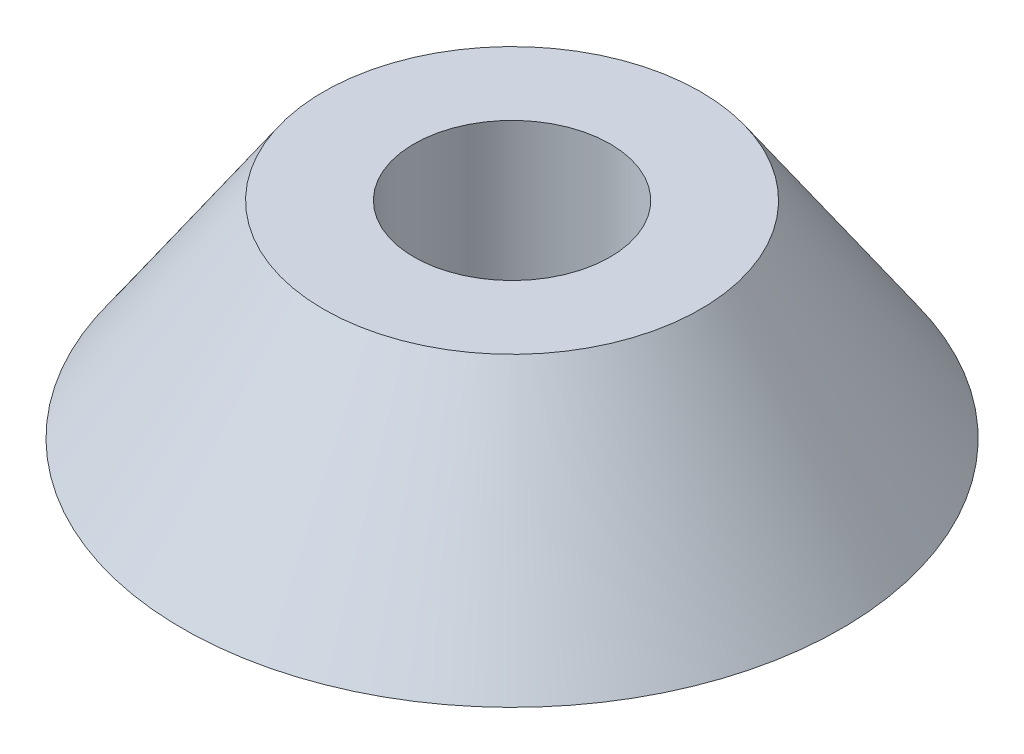
ISO-10303-21;
HEADER;
FILE_DESCRIPTION(('STEP AP214'),'2;1');
FILE_NAME('part.step','',(''),(''),'','','');
FILE_SCHEMA(('AUTOMOTIVE_DESIGN { 1 0 10303 214 1 1 1 1 }'));
ENDSEC;
DATA;
#1=APPLICATION_CONTEXT('core data for automotive mechanical design processes');
#2=APPLICATION_PROTOCOL_DEFINITION('international standard','automotive_design',2000,#1);
#3=PRODUCT_CONTEXT('',#1,'mechanical');
#4=PRODUCT('Part','Part','',(#3));
#5=PRODUCT_RELATED_PRODUCT_CATEGORY('part','',(#4));
#6=PRODUCT_DEFINITION_FORMATION('','',#4);
#7=PRODUCT_DEFINITION_CONTEXT('part definition',#1,'design');
#8=PRODUCT_DEFINITION('design','',#6,#7);
#9=PRODUCT_DEFINITION_SHAPE('','',#8);
#10=(LENGTH_UNIT() NAMED_UNIT(*) SI_UNIT(.MILLI.,.METRE.));
#11=(NAMED_UNIT(*) PLANE_ANGLE_UNIT() SI_UNIT($,.RADIAN.));
#12=(NAMED_UNIT(*) SI_UNIT($,.STERADIAN.) SOLID_ANGLE_UNIT());
#13=UNCERTAINTY_MEASURE_WITH_UNIT(LENGTH_MEASURE(1.E-05),#10,'distance_accuracy_value','');
#14=(GEOMETRIC_REPRESENTATION_CONTEXT(3) GLOBAL_UNCERTAINTY_ASSIGNED_CONTEXT((#13)) GLOBAL_UNIT_ASSIGNED_CONTEXT((#10,
#11,#12)) REPRESENTATION_CONTEXT('',''));
#15=CARTESIAN_POINT('',(0.,0.,0.));
#16=DIRECTION('',(0.,0.,1.));
#17=DIRECTION('',(1.,0.,0.));
#18=AXIS2_PLACEMENT_3D('',#15,#16,#17);
#19=CARTESIAN_POINT('',(15.9999999999998,0.,0.));
#20=DIRECTION('',(0.,-1.,0.));
#21=DIRECTION('',(0.,0.,-1.));
#22=AXIS2_PLACEMENT_3D('',#19,#20,#21);
#23=PLANE('',#22);
#24=CARTESIAN_POINT('',(0.,0.,0.));
#25=DIRECTION('',(0.,-1.,0.));
#26=DIRECTION('',(0.,0.,-1.));
#27=AXIS2_PLACEMENT_3D('',#24,#25,#26);
#28=CIRCLE('',#27,16.);
#29=CARTESIAN_POINT('',(0.,0.,-16.));
#30=VERTEX_POINT('',#29);
#31=EDGE_CURVE('E42',#30,#30,#28,.T.);
#32=ORIENTED_EDGE('',*,*,#31,.T.);
#33=EDGE_LOOP('',(#32));
#34=FACE_BOUND('',#33,.T.);
#35=CARTESIAN_POINT('',(0.,0.,0.));
#36=DIRECTION('',(0.,-1.,0.));
#37=DIRECTION('',(0.,0.,-1.));
#38=AXIS2_PLACEMENT_3D('',#35,#36,#37);
#39=CIRCLE('',#38,4.7625);
#40=CARTESIAN_POINT('',(0.,0.,-4.76250000000001));
#41=VERTEX_POINT('',#40);
#42=EDGE_CURVE('E10',#41,#41,#39,.T.);
#43=ORIENTED_EDGE('',*,*,#42,.F.);
#44=EDGE_LOOP('',(#43));
#45=FACE_BOUND('',#44,.T.);
#46=ADVANCED_FACE('F28',(#34,#45),#23,.T.);
#47=CARTESIAN_POINT('',(0.,0.,0.));
#48=DIRECTION('',(0.,-1.,0.));
#49=DIRECTION('',(0.,0.,-1.));
#50=AXIS2_PLACEMENT_3D('',#47,#48,#49);
#51=CYLINDRICAL_SURFACE('',#50,4.7625);
#52=ORIENTED_EDGE('',*,*,#42,.T.);
#53=EDGE_LOOP('',(#52));
#54=FACE_BOUND('',#53,.T.);
#55=CARTESIAN_POINT('',(0.,10.,0.));
#56=DIRECTION('',(0.,-1.,0.));
#57=DIRECTION('',(0.,0.,-1.));
#58=AXIS2_PLACEMENT_3D('',#55,#56,#57);
#59=CIRCLE('',#58,4.7625);
#60=CARTESIAN_POINT('',(0.,10.,-4.76250000000001));
#61=VERTEX_POINT('',#60);
#62=EDGE_CURVE('E34',#61,#61,#59,.T.);
#63=ORIENTED_EDGE('',*,*,#62,.F.);
#64=EDGE_LOOP('',(#63));
#65=FACE_BOUND('',#64,.T.);
#66=ADVANCED_FACE('F58',(#54,#65),#51,.F.);
#67=CARTESIAN_POINT('',(4.76249999999992,10.,-2.72004641033163E-12));
#68=DIRECTION('',(0.,1.,0.));
#69=DIRECTION('',(0.,0.,1.));
#70=AXIS2_PLACEMENT_3D('',#67,#68,#69);
#71=PLANE('',#70);
#72=ORIENTED_EDGE('',*,*,#62,.T.);
#73=EDGE_LOOP('',(#72));
#74=FACE_BOUND('',#73,.T.);
#75=CARTESIAN_POINT('',(0.,10.,0.));
#76=DIRECTION('',(0.,-1.,0.));
#77=DIRECTION('',(0.,0.,-1.));
#78=AXIS2_PLACEMENT_3D('',#75,#76,#77);
#79=CIRCLE('',#78,9.15);
#80=CARTESIAN_POINT('',(0.,10.,-9.15000000000002));
#81=VERTEX_POINT('',#80);
#82=EDGE_CURVE('E38',#81,#81,#79,.T.);
#83=ORIENTED_EDGE('',*,*,#82,.F.);
#84=EDGE_LOOP('',(#83));
#85=FACE_BOUND('',#84,.T.);
#86=ADVANCED_FACE('F52',(#74,#85),#71,.T.);
#87=CARTESIAN_POINT('',(0.,0.,0.));
#88=DIRECTION('',(0.,-1.,0.));
#89=DIRECTION('',(0.,0.,-1.));
#90=AXIS2_PLACEMENT_3D('',#87,#88,#89);
#91=CONICAL_SURFACE('',#90,16.,0.600587751425594);
#92=ORIENTED_EDGE('',*,*,#82,.T.);
#93=EDGE_LOOP('',(#92));
#94=FACE_BOUND('',#93,.T.);
#95=ORIENTED_EDGE('',*,*,#31,.F.);
#96=EDGE_LOOP('',(#95));
#97=FACE_BOUND('',#96,.T.);
#98=ADVANCED_FACE('F50',(#94,#97),#91,.T.);
#99=CLOSED_SHELL('',(#46,#66,#86,#98));
#100=MANIFOLD_SOLID_BREP('B2',#99);
#101=ADVANCED_BREP_SHAPE_REPRESENTATION('',(#18,#100),#14);
#102=SHAPE_DEFINITION_REPRESENTATION(#9,#101);
ENDSEC;
END-ISO-10303-21;
